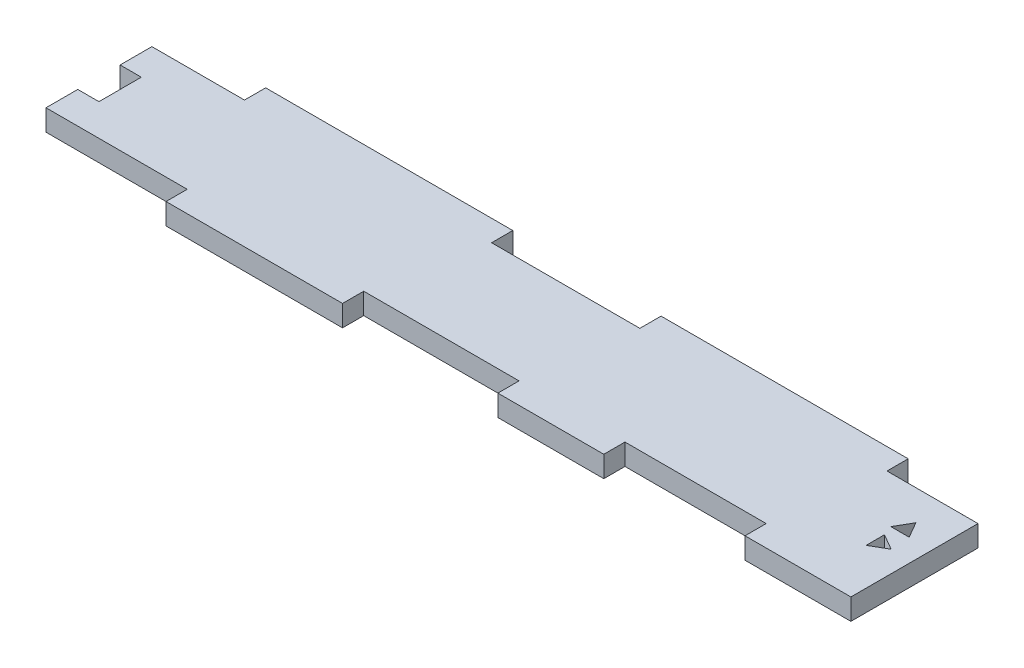
ISO-10303-21;
HEADER;
FILE_DESCRIPTION(('STEP AP214'),'2;1');
FILE_NAME('part.step','',(''),(''),'','','');
FILE_SCHEMA(('AUTOMOTIVE_DESIGN { 1 0 10303 214 1 1 1 1 }'));
ENDSEC;
DATA;
#1=APPLICATION_CONTEXT('core data for automotive mechanical design processes');
#2=APPLICATION_PROTOCOL_DEFINITION('international standard','automotive_design',2000,#1);
#3=PRODUCT_CONTEXT('',#1,'mechanical');
#4=PRODUCT('Part','Part','',(#3));
#5=PRODUCT_RELATED_PRODUCT_CATEGORY('part','',(#4));
#6=PRODUCT_DEFINITION_FORMATION('','',#4);
#7=PRODUCT_DEFINITION_CONTEXT('part definition',#1,'design');
#8=PRODUCT_DEFINITION('design','',#6,#7);
#9=PRODUCT_DEFINITION_SHAPE('','',#8);
#10=(LENGTH_UNIT() NAMED_UNIT(*) SI_UNIT(.MILLI.,.METRE.));
#11=(NAMED_UNIT(*) PLANE_ANGLE_UNIT() SI_UNIT($,.RADIAN.));
#12=(NAMED_UNIT(*) SI_UNIT($,.STERADIAN.) SOLID_ANGLE_UNIT());
#13=UNCERTAINTY_MEASURE_WITH_UNIT(LENGTH_MEASURE(1.E-05),#10,'distance_accuracy_value','');
#14=(GEOMETRIC_REPRESENTATION_CONTEXT(3) GLOBAL_UNCERTAINTY_ASSIGNED_CONTEXT((#13)) GLOBAL_UNIT_ASSIGNED_CONTEXT((#10,
#11,#12)) REPRESENTATION_CONTEXT('',''));
#15=CARTESIAN_POINT('',(0.,0.,0.));
#16=DIRECTION('',(0.,0.,1.));
#17=DIRECTION('',(1.,0.,0.));
#18=AXIS2_PLACEMENT_3D('',#15,#16,#17);
#19=CARTESIAN_POINT('',(-58.5,1.5,-7.5));
#20=DIRECTION('',(1.,0.,0.));
#21=DIRECTION('',(0.,0.,-1.));
#22=AXIS2_PLACEMENT_3D('',#19,#20,#21);
#23=PLANE('',#22);
#24=DIRECTION('',(0.,0.,1.));
#25=VECTOR('',#24,1.);
#26=CARTESIAN_POINT('',(-58.5,-1.5,-7.5));
#27=LINE('',#26,#25);
#28=CARTESIAN_POINT('',(-58.5,-1.5,-7.5));
#29=VERTEX_POINT('',#28);
#30=CARTESIAN_POINT('',(-58.5,-1.5,-3.));
#31=VERTEX_POINT('',#30);
#32=EDGE_CURVE('E292',#29,#31,#27,.T.);
#33=ORIENTED_EDGE('',*,*,#32,.T.);
#34=DIRECTION('',(0.,1.,0.));
#35=VECTOR('',#34,1.);
#36=CARTESIAN_POINT('',(-58.5,-1.5,-3.));
#37=LINE('',#36,#35);
#38=CARTESIAN_POINT('',(-58.5,1.5,-3.));
#39=VERTEX_POINT('',#38);
#40=EDGE_CURVE('E496',#31,#39,#37,.T.);
#41=ORIENTED_EDGE('',*,*,#40,.T.);
#42=DIRECTION('',(0.,0.,1.));
#43=VECTOR('',#42,1.);
#44=CARTESIAN_POINT('',(-58.5,1.5,-7.5));
#45=LINE('',#44,#43);
#46=CARTESIAN_POINT('',(-58.5,1.5,-7.5));
#47=VERTEX_POINT('',#46);
#48=EDGE_CURVE('E269',#47,#39,#45,.T.);
#49=ORIENTED_EDGE('',*,*,#48,.F.);
#50=DIRECTION('',(0.,-1.,0.));
#51=VECTOR('',#50,1.);
#52=CARTESIAN_POINT('',(-58.5,1.5,-7.5));
#53=LINE('',#52,#51);
#54=EDGE_CURVE('E290',#47,#29,#53,.T.);
#55=ORIENTED_EDGE('',*,*,#54,.T.);
#56=EDGE_LOOP('',(#33,#41,#49,#55));
#57=FACE_BOUND('',#56,.T.);
#58=ADVANCED_FACE('F36',(#57),#23,.F.);
#59=CARTESIAN_POINT('',(-58.5,1.5,-7.5));
#60=DIRECTION('',(0.,0.,1.));
#61=DIRECTION('',(1.,0.,0.));
#62=AXIS2_PLACEMENT_3D('',#59,#60,#61);
#63=PLANE('',#62);
#64=DIRECTION('',(0.,-1.,0.));
#65=VECTOR('',#64,1.);
#66=CARTESIAN_POINT('',(10.61,1.5,-7.49999999999999));
#67=LINE('',#66,#65);
#68=CARTESIAN_POINT('',(10.61,1.5,-7.5));
#69=VERTEX_POINT('',#68);
#70=CARTESIAN_POINT('',(10.61,-1.5,-7.49999999999999));
#71=VERTEX_POINT('',#70);
#72=EDGE_CURVE('E339',#69,#71,#67,.T.);
#73=ORIENTED_EDGE('',*,*,#72,.T.);
#74=DIRECTION('',(-1.,0.,0.));
#75=VECTOR('',#74,1.);
#76=CARTESIAN_POINT('',(-58.5,-1.5,-7.5));
#77=LINE('',#76,#75);
#78=CARTESIAN_POINT('',(-10.39,-1.5,-7.49999999999999));
#79=VERTEX_POINT('',#78);
#80=EDGE_CURVE('E274',#71,#79,#77,.T.);
#81=ORIENTED_EDGE('',*,*,#80,.T.);
#82=DIRECTION('',(0.,-1.,0.));
#83=VECTOR('',#82,1.);
#84=CARTESIAN_POINT('',(-10.39,1.5,-7.49999999999999));
#85=LINE('',#84,#83);
#86=CARTESIAN_POINT('',(-10.39,1.5,-7.49999999999999));
#87=VERTEX_POINT('',#86);
#88=EDGE_CURVE('E360',#87,#79,#85,.T.);
#89=ORIENTED_EDGE('',*,*,#88,.F.);
#90=DIRECTION('',(-1.,0.,0.));
#91=VECTOR('',#90,1.);
#92=CARTESIAN_POINT('',(-58.5,1.5,-7.5));
#93=LINE('',#92,#91);
#94=EDGE_CURVE('E291',#69,#87,#93,.T.);
#95=ORIENTED_EDGE('',*,*,#94,.F.);
#96=EDGE_LOOP('',(#73,#81,#89,#95));
#97=FACE_BOUND('',#96,.T.);
#98=ADVANCED_FACE('F485',(#97),#63,.F.);
#99=DIRECTION('',(0.,-1.,0.));
#100=VECTOR('',#99,1.);
#101=CARTESIAN_POINT('',(45.61,1.5,-7.49999999999999));
#102=LINE('',#101,#100);
#103=CARTESIAN_POINT('',(45.61,1.5,-7.49999999999999));
#104=VERTEX_POINT('',#103);
#105=CARTESIAN_POINT('',(45.61,-1.5,-7.49999999999999));
#106=VERTEX_POINT('',#105);
#107=EDGE_CURVE('E337',#104,#106,#102,.T.);
#108=ORIENTED_EDGE('',*,*,#107,.F.);
#109=CARTESIAN_POINT('',(58.5,1.5,-7.49999999999999));
#110=VERTEX_POINT('',#109);
#111=EDGE_CURVE('E287',#110,#104,#93,.T.);
#112=ORIENTED_EDGE('',*,*,#111,.F.);
#113=DIRECTION('',(0.,-1.,0.));
#114=VECTOR('',#113,1.);
#115=CARTESIAN_POINT('',(58.5,1.5,-7.49999999999999));
#116=LINE('',#115,#114);
#117=CARTESIAN_POINT('',(58.5,-1.5,-7.49999999999999));
#118=VERTEX_POINT('',#117);
#119=EDGE_CURVE('E44',#110,#118,#116,.T.);
#120=ORIENTED_EDGE('',*,*,#119,.T.);
#121=EDGE_CURVE('E270',#118,#106,#77,.T.);
#122=ORIENTED_EDGE('',*,*,#121,.T.);
#123=EDGE_LOOP('',(#108,#112,#120,#122));
#124=FACE_BOUND('',#123,.T.);
#125=ADVANCED_FACE('F308',(#124),#63,.F.);
#126=CARTESIAN_POINT('',(-58.5,1.5,7.5));
#127=DIRECTION('',(0.,0.,-1.));
#128=DIRECTION('',(-1.,0.,0.));
#129=AXIS2_PLACEMENT_3D('',#126,#127,#128);
#130=PLANE('',#129);
#131=DIRECTION('',(0.,-1.,0.));
#132=VECTOR('',#131,1.);
#133=CARTESIAN_POINT('',(-38.5,1.5,7.5));
#134=LINE('',#133,#132);
#135=CARTESIAN_POINT('',(-38.5,1.5,7.5));
#136=VERTEX_POINT('',#135);
#137=CARTESIAN_POINT('',(-38.5,-1.5,7.5));
#138=VERTEX_POINT('',#137);
#139=EDGE_CURVE('E376',#136,#138,#134,.T.);
#140=ORIENTED_EDGE('',*,*,#139,.F.);
#141=DIRECTION('',(1.,0.,0.));
#142=VECTOR('',#141,1.);
#143=CARTESIAN_POINT('',(-58.5,1.5,7.5));
#144=LINE('',#143,#142);
#145=CARTESIAN_POINT('',(-58.5,1.5,7.5));
#146=VERTEX_POINT('',#145);
#147=EDGE_CURVE('E281',#146,#136,#144,.T.);
#148=ORIENTED_EDGE('',*,*,#147,.F.);
#149=DIRECTION('',(0.,-1.,0.));
#150=VECTOR('',#149,1.);
#151=CARTESIAN_POINT('',(-58.5,1.5,7.5));
#152=LINE('',#151,#150);
#153=CARTESIAN_POINT('',(-58.5,-1.5,7.5));
#154=VERTEX_POINT('',#153);
#155=EDGE_CURVE('E11',#146,#154,#152,.T.);
#156=ORIENTED_EDGE('',*,*,#155,.T.);
#157=DIRECTION('',(1.,0.,0.));
#158=VECTOR('',#157,1.);
#159=CARTESIAN_POINT('',(-58.5,-1.5,7.5));
#160=LINE('',#159,#158);
#161=EDGE_CURVE('E297',#154,#138,#160,.T.);
#162=ORIENTED_EDGE('',*,*,#161,.T.);
#163=EDGE_LOOP('',(#140,#148,#156,#162));
#164=FACE_BOUND('',#163,.T.);
#165=ADVANCED_FACE('F445',(#164),#130,.F.);
#166=DIRECTION('',(0.,-1.,0.));
#167=VECTOR('',#166,1.);
#168=CARTESIAN_POINT('',(-13.5,1.5,7.5));
#169=LINE('',#168,#167);
#170=CARTESIAN_POINT('',(-13.5,1.5,7.5));
#171=VERTEX_POINT('',#170);
#172=CARTESIAN_POINT('',(-13.5,-1.5,7.5));
#173=VERTEX_POINT('',#172);
#174=EDGE_CURVE('E385',#171,#173,#169,.T.);
#175=ORIENTED_EDGE('',*,*,#174,.T.);
#176=CARTESIAN_POINT('',(8.5,-1.5,7.5));
#177=VERTEX_POINT('',#176);
#178=EDGE_CURVE('E300',#173,#177,#160,.T.);
#179=ORIENTED_EDGE('',*,*,#178,.T.);
#180=DIRECTION('',(0.,-1.,0.));
#181=VECTOR('',#180,1.);
#182=CARTESIAN_POINT('',(8.5,1.5,7.5));
#183=LINE('',#182,#181);
#184=CARTESIAN_POINT('',(8.5,1.5,7.5));
#185=VERTEX_POINT('',#184);
#186=EDGE_CURVE('E423',#185,#177,#183,.T.);
#187=ORIENTED_EDGE('',*,*,#186,.F.);
#188=EDGE_CURVE('E284',#171,#185,#144,.T.);
#189=ORIENTED_EDGE('',*,*,#188,.F.);
#190=EDGE_LOOP('',(#175,#179,#187,#189));
#191=FACE_BOUND('',#190,.T.);
#192=ADVANCED_FACE('F460',(#191),#130,.F.);
#193=DIRECTION('',(0.,-1.,0.));
#194=VECTOR('',#193,1.);
#195=CARTESIAN_POINT('',(43.5,1.5,7.5));
#196=LINE('',#195,#194);
#197=CARTESIAN_POINT('',(43.5,1.5,7.49999999999999));
#198=VERTEX_POINT('',#197);
#199=CARTESIAN_POINT('',(43.5,-1.5,7.49999999999999));
#200=VERTEX_POINT('',#199);
#201=EDGE_CURVE('E402',#198,#200,#196,.T.);
#202=ORIENTED_EDGE('',*,*,#201,.F.);
#203=CARTESIAN_POINT('',(23.5,1.5,7.5));
#204=VERTEX_POINT('',#203);
#205=EDGE_CURVE('E273',#204,#198,#144,.T.);
#206=ORIENTED_EDGE('',*,*,#205,.F.);
#207=DIRECTION('',(0.,-1.,0.));
#208=VECTOR('',#207,1.);
#209=CARTESIAN_POINT('',(23.5,1.5,7.5));
#210=LINE('',#209,#208);
#211=CARTESIAN_POINT('',(23.5,-1.5,7.49999999999999));
#212=VERTEX_POINT('',#211);
#213=EDGE_CURVE('E431',#204,#212,#210,.T.);
#214=ORIENTED_EDGE('',*,*,#213,.T.);
#215=EDGE_CURVE('E295',#212,#200,#160,.T.);
#216=ORIENTED_EDGE('',*,*,#215,.T.);
#217=EDGE_LOOP('',(#202,#206,#214,#216));
#218=FACE_BOUND('',#217,.T.);
#219=ADVANCED_FACE('F486',(#218),#130,.F.);
#220=CARTESIAN_POINT('',(-58.5,1.5,3.));
#221=VERTEX_POINT('',#220);
#222=EDGE_CURVE('E263',#221,#146,#45,.T.);
#223=ORIENTED_EDGE('',*,*,#222,.F.);
#224=DIRECTION('',(0.,1.,0.));
#225=VECTOR('',#224,1.);
#226=CARTESIAN_POINT('',(-58.5,-1.5,3.));
#227=LINE('',#226,#225);
#228=CARTESIAN_POINT('',(-58.5,-1.5,3.));
#229=VERTEX_POINT('',#228);
#230=EDGE_CURVE('E245',#229,#221,#227,.T.);
#231=ORIENTED_EDGE('',*,*,#230,.F.);
#232=EDGE_CURVE('E296',#229,#154,#27,.T.);
#233=ORIENTED_EDGE('',*,*,#232,.T.);
#234=ORIENTED_EDGE('',*,*,#155,.F.);
#235=EDGE_LOOP('',(#223,#231,#233,#234));
#236=FACE_BOUND('',#235,.T.);
#237=ADVANCED_FACE('F38',(#236),#23,.F.);
#238=CARTESIAN_POINT('',(58.5,1.5,-7.49999999999999));
#239=DIRECTION('',(-1.,0.,0.));
#240=DIRECTION('',(0.,0.,1.));
#241=AXIS2_PLACEMENT_3D('',#238,#239,#240);
#242=PLANE('',#241);
#243=DIRECTION('',(0.,0.,-1.));
#244=VECTOR('',#243,1.);
#245=CARTESIAN_POINT('',(58.5,-1.5,-7.49999999999999));
#246=LINE('',#245,#244);
#247=CARTESIAN_POINT('',(58.5,-1.5,10.5));
#248=VERTEX_POINT('',#247);
#249=EDGE_CURVE('E299',#248,#118,#246,.T.);
#250=ORIENTED_EDGE('',*,*,#249,.T.);
#251=ORIENTED_EDGE('',*,*,#119,.F.);
#252=DIRECTION('',(0.,0.,-1.));
#253=VECTOR('',#252,1.);
#254=CARTESIAN_POINT('',(58.5,1.5,-7.49999999999999));
#255=LINE('',#254,#253);
#256=CARTESIAN_POINT('',(58.5,1.5,10.5));
#257=VERTEX_POINT('',#256);
#258=EDGE_CURVE('E283',#257,#110,#255,.T.);
#259=ORIENTED_EDGE('',*,*,#258,.F.);
#260=DIRECTION('',(0.,-1.,0.));
#261=VECTOR('',#260,1.);
#262=CARTESIAN_POINT('',(58.5,1.5,10.5));
#263=LINE('',#262,#261);
#264=EDGE_CURVE('E408',#257,#248,#263,.T.);
#265=ORIENTED_EDGE('',*,*,#264,.T.);
#266=EDGE_LOOP('',(#250,#251,#259,#265));
#267=FACE_BOUND('',#266,.T.);
#268=ADVANCED_FACE('F475',(#267),#242,.F.);
#269=CARTESIAN_POINT('',(-45.39,1.5,-7.49999999999999));
#270=VERTEX_POINT('',#269);
#271=EDGE_CURVE('E286',#270,#47,#93,.T.);
#272=ORIENTED_EDGE('',*,*,#271,.F.);
#273=DIRECTION('',(0.,-1.,0.));
#274=VECTOR('',#273,1.);
#275=CARTESIAN_POINT('',(-45.39,1.5,-7.49999999999999));
#276=LINE('',#275,#274);
#277=CARTESIAN_POINT('',(-45.39,-1.5,-7.5));
#278=VERTEX_POINT('',#277);
#279=EDGE_CURVE('E363',#270,#278,#276,.T.);
#280=ORIENTED_EDGE('',*,*,#279,.T.);
#281=EDGE_CURVE('E276',#278,#29,#77,.T.);
#282=ORIENTED_EDGE('',*,*,#281,.T.);
#283=ORIENTED_EDGE('',*,*,#54,.F.);
#284=EDGE_LOOP('',(#272,#280,#282,#283));
#285=FACE_BOUND('',#284,.T.);
#286=ADVANCED_FACE('F477',(#285),#63,.F.);
#287=CARTESIAN_POINT('',(0.,1.5,0.));
#288=DIRECTION('',(0.,1.,0.));
#289=DIRECTION('',(0.,0.,1.));
#290=AXIS2_PLACEMENT_3D('',#287,#288,#289);
#291=PLANE('',#290);
#292=DIRECTION('',(-1.,0.,0.));
#293=VECTOR('',#292,1.);
#294=CARTESIAN_POINT('',(-58.5,1.5,-3.));
#295=LINE('',#294,#293);
#296=CARTESIAN_POINT('',(-55.5,1.5,-3.));
#297=VERTEX_POINT('',#296);
#298=EDGE_CURVE('E759',#297,#39,#295,.T.);
#299=ORIENTED_EDGE('',*,*,#298,.F.);
#300=DIRECTION('',(0.,0.,-1.));
#301=VECTOR('',#300,1.);
#302=CARTESIAN_POINT('',(-55.5,1.5,-3.));
#303=LINE('',#302,#301);
#304=CARTESIAN_POINT('',(-55.5,1.5,3.));
#305=VERTEX_POINT('',#304);
#306=EDGE_CURVE('E266',#305,#297,#303,.T.);
#307=ORIENTED_EDGE('',*,*,#306,.F.);
#308=DIRECTION('',(1.,0.,0.));
#309=VECTOR('',#308,1.);
#310=CARTESIAN_POINT('',(-58.5,1.5,3.));
#311=LINE('',#310,#309);
#312=EDGE_CURVE('E248',#221,#305,#311,.T.);
#313=ORIENTED_EDGE('',*,*,#312,.F.);
#314=ORIENTED_EDGE('',*,*,#222,.T.);
#315=ORIENTED_EDGE('',*,*,#147,.T.);
#316=DIRECTION('',(0.,0.,1.));
#317=VECTOR('',#316,1.);
#318=CARTESIAN_POINT('',(-38.5,1.5,7.5));
#319=LINE('',#318,#317);
#320=CARTESIAN_POINT('',(-38.5,1.5,10.5));
#321=VERTEX_POINT('',#320);
#322=EDGE_CURVE('E367',#136,#321,#319,.T.);
#323=ORIENTED_EDGE('',*,*,#322,.T.);
#324=DIRECTION('',(1.,0.,0.));
#325=VECTOR('',#324,1.);
#326=CARTESIAN_POINT('',(-38.5,1.5,10.5));
#327=LINE('',#326,#325);
#328=CARTESIAN_POINT('',(-13.5,1.5,10.5));
#329=VERTEX_POINT('',#328);
#330=EDGE_CURVE('E370',#321,#329,#327,.T.);
#331=ORIENTED_EDGE('',*,*,#330,.T.);
#332=DIRECTION('',(0.,0.,-1.));
#333=VECTOR('',#332,1.);
#334=CARTESIAN_POINT('',(-13.5,1.5,7.5));
#335=LINE('',#334,#333);
#336=EDGE_CURVE('E373',#329,#171,#335,.T.);
#337=ORIENTED_EDGE('',*,*,#336,.T.);
#338=ORIENTED_EDGE('',*,*,#188,.T.);
#339=DIRECTION('',(0.,0.,1.));
#340=VECTOR('',#339,1.);
#341=CARTESIAN_POINT('',(8.5,1.5,7.5));
#342=LINE('',#341,#340);
#343=CARTESIAN_POINT('',(8.5,1.5,10.5));
#344=VERTEX_POINT('',#343);
#345=EDGE_CURVE('E415',#185,#344,#342,.T.);
#346=ORIENTED_EDGE('',*,*,#345,.T.);
#347=DIRECTION('',(1.,0.,0.));
#348=VECTOR('',#347,1.);
#349=CARTESIAN_POINT('',(8.5,1.5,10.5));
#350=LINE('',#349,#348);
#351=CARTESIAN_POINT('',(23.5,1.5,10.5));
#352=VERTEX_POINT('',#351);
#353=EDGE_CURVE('E418',#344,#352,#350,.T.);
#354=ORIENTED_EDGE('',*,*,#353,.T.);
#355=DIRECTION('',(0.,0.,-1.));
#356=VECTOR('',#355,1.);
#357=CARTESIAN_POINT('',(23.5,1.5,7.5));
#358=LINE('',#357,#356);
#359=EDGE_CURVE('E421',#352,#204,#358,.T.);
#360=ORIENTED_EDGE('',*,*,#359,.T.);
#361=ORIENTED_EDGE('',*,*,#205,.T.);
#362=DIRECTION('',(0.,0.,1.));
#363=VECTOR('',#362,1.);
#364=CARTESIAN_POINT('',(43.5,1.5,7.5));
#365=LINE('',#364,#363);
#366=CARTESIAN_POINT('',(43.5,1.5,10.5));
#367=VERTEX_POINT('',#366);
#368=EDGE_CURVE('E395',#198,#367,#365,.T.);
#369=ORIENTED_EDGE('',*,*,#368,.T.);
#370=DIRECTION('',(1.,0.,0.));
#371=VECTOR('',#370,1.);
#372=CARTESIAN_POINT('',(43.5,1.5,10.5));
#373=LINE('',#372,#371);
#374=EDGE_CURVE('E398',#367,#257,#373,.T.);
#375=ORIENTED_EDGE('',*,*,#374,.T.);
#376=ORIENTED_EDGE('',*,*,#258,.T.);
#377=ORIENTED_EDGE('',*,*,#111,.T.);
#378=DIRECTION('',(0.,0.,-1.));
#379=VECTOR('',#378,1.);
#380=CARTESIAN_POINT('',(45.61,1.5,-10.5));
#381=LINE('',#380,#379);
#382=CARTESIAN_POINT('',(45.61,1.5,-10.5));
#383=VERTEX_POINT('',#382);
#384=EDGE_CURVE('E558',#104,#383,#381,.T.);
#385=ORIENTED_EDGE('',*,*,#384,.T.);
#386=DIRECTION('',(-1.,0.,0.));
#387=VECTOR('',#386,1.);
#388=CARTESIAN_POINT('',(10.61,1.5,-10.5));
#389=LINE('',#388,#387);
#390=CARTESIAN_POINT('',(10.61,1.5,-10.5));
#391=VERTEX_POINT('',#390);
#392=EDGE_CURVE('E335',#383,#391,#389,.T.);
#393=ORIENTED_EDGE('',*,*,#392,.T.);
#394=DIRECTION('',(0.,0.,1.));
#395=VECTOR('',#394,1.);
#396=CARTESIAN_POINT('',(10.61,1.5,-10.5));
#397=LINE('',#396,#395);
#398=EDGE_CURVE('E324',#391,#69,#397,.T.);
#399=ORIENTED_EDGE('',*,*,#398,.T.);
#400=ORIENTED_EDGE('',*,*,#94,.T.);
#401=DIRECTION('',(0.,0.,-1.));
#402=VECTOR('',#401,1.);
#403=CARTESIAN_POINT('',(-10.39,1.5,-7.49999999999999));
#404=LINE('',#403,#402);
#405=CARTESIAN_POINT('',(-10.39,1.5,-10.5));
#406=VERTEX_POINT('',#405);
#407=EDGE_CURVE('E345',#87,#406,#404,.T.);
#408=ORIENTED_EDGE('',*,*,#407,.T.);
#409=DIRECTION('',(-1.,0.,0.));
#410=VECTOR('',#409,1.);
#411=CARTESIAN_POINT('',(-45.39,1.5,-10.5));
#412=LINE('',#411,#410);
#413=CARTESIAN_POINT('',(-45.39,1.5,-10.5));
#414=VERTEX_POINT('',#413);
#415=EDGE_CURVE('E348',#406,#414,#412,.T.);
#416=ORIENTED_EDGE('',*,*,#415,.T.);
#417=DIRECTION('',(0.,0.,1.));
#418=VECTOR('',#417,1.);
#419=CARTESIAN_POINT('',(-45.39,1.5,-7.49999999999999));
#420=LINE('',#419,#418);
#421=EDGE_CURVE('E343',#414,#270,#420,.T.);
#422=ORIENTED_EDGE('',*,*,#421,.T.);
#423=ORIENTED_EDGE('',*,*,#271,.T.);
#424=ORIENTED_EDGE('',*,*,#48,.T.);
#425=EDGE_LOOP('',(#299,#307,#313,#314,#315,#323,#331,#337,#338,#346,#354,#360,#361,#369,#375,
#376,#377,#385,#393,#399,#400,#408,#416,#422,#423,#424));
#426=FACE_BOUND('',#425,.T.);
#427=DIRECTION('',(0.866025403784438,0.,-0.500000000000001));
#428=VECTOR('',#427,1.);
#429=CARTESIAN_POINT('',(53.25,1.5,3.09807621135332));
#430=LINE('',#429,#428);
#431=CARTESIAN_POINT('',(53.25,1.5,3.09807621135332));
#432=VERTEX_POINT('',#431);
#433=CARTESIAN_POINT('',(55.5,1.5,1.79903810567665));
#434=VERTEX_POINT('',#433);
#435=EDGE_CURVE('E59',#432,#434,#430,.T.);
#436=ORIENTED_EDGE('',*,*,#435,.F.);
#437=DIRECTION('',(0.,0.,1.));
#438=VECTOR('',#437,1.);
#439=CARTESIAN_POINT('',(53.25,1.5,0.5));
#440=LINE('',#439,#438);
#441=CARTESIAN_POINT('',(53.25,1.5,0.5));
#442=VERTEX_POINT('',#441);
#443=EDGE_CURVE('E517',#442,#432,#440,.T.);
#444=ORIENTED_EDGE('',*,*,#443,.F.);
#445=DIRECTION('',(-0.866025403784441,0.,-0.499999999999997));
#446=VECTOR('',#445,1.);
#447=CARTESIAN_POINT('',(55.5,1.5,1.79903810567665));
#448=LINE('',#447,#446);
#449=EDGE_CURVE('E513',#434,#442,#448,.T.);
#450=ORIENTED_EDGE('',*,*,#449,.F.);
#451=EDGE_LOOP('',(#436,#444,#450));
#452=FACE_BOUND('',#451,.T.);
#453=DIRECTION('',(-0.5,0.,-0.866025403784438));
#454=VECTOR('',#453,1.);
#455=CARTESIAN_POINT('',(55.2990381056767,1.5,-0.952955395936156));
#456=LINE('',#455,#454);
#457=CARTESIAN_POINT('',(55.2990381056767,1.5,-0.952955395936156));
#458=VERTEX_POINT('',#457);
#459=CARTESIAN_POINT('',(54.,1.5,-3.20295539593614));
#460=VERTEX_POINT('',#459);
#461=EDGE_CURVE('E508',#458,#460,#456,.T.);
#462=ORIENTED_EDGE('',*,*,#461,.F.);
#463=DIRECTION('',(1.,0.,0.));
#464=VECTOR('',#463,1.);
#465=CARTESIAN_POINT('',(52.7009618943233,1.5,-0.952955395936156));
#466=LINE('',#465,#464);
#467=CARTESIAN_POINT('',(52.7009618943233,1.5,-0.952955395936156));
#468=VERTEX_POINT('',#467);
#469=EDGE_CURVE('E538',#468,#458,#466,.T.);
#470=ORIENTED_EDGE('',*,*,#469,.F.);
#471=DIRECTION('',(-0.5,0.,0.866025403784438));
#472=VECTOR('',#471,1.);
#473=CARTESIAN_POINT('',(54.,1.5,-3.20295539593614));
#474=LINE('',#473,#472);
#475=EDGE_CURVE('E535',#460,#468,#474,.T.);
#476=ORIENTED_EDGE('',*,*,#475,.F.);
#477=EDGE_LOOP('',(#462,#470,#476));
#478=FACE_BOUND('',#477,.T.);
#479=ADVANCED_FACE('F260',(#426,#452,#478),#291,.T.);
#480=CARTESIAN_POINT('',(0.,-1.5,0.));
#481=DIRECTION('',(0.,1.,0.));
#482=DIRECTION('',(0.,0.,1.));
#483=AXIS2_PLACEMENT_3D('',#480,#481,#482);
#484=PLANE('',#483);
#485=DIRECTION('',(0.,0.,1.));
#486=VECTOR('',#485,1.);
#487=CARTESIAN_POINT('',(53.25,-1.5,0.5));
#488=LINE('',#487,#486);
#489=CARTESIAN_POINT('',(53.25,-1.5,0.499999999999997));
#490=VERTEX_POINT('',#489);
#491=CARTESIAN_POINT('',(53.25,-1.5,3.09807621135332));
#492=VERTEX_POINT('',#491);
#493=EDGE_CURVE('E526',#490,#492,#488,.T.);
#494=ORIENTED_EDGE('',*,*,#493,.T.);
#495=DIRECTION('',(0.866025403784438,0.,-0.500000000000001));
#496=VECTOR('',#495,1.);
#497=CARTESIAN_POINT('',(53.25,-1.5,3.09807621135332));
#498=LINE('',#497,#496);
#499=CARTESIAN_POINT('',(55.5,-1.5,1.79903810567665));
#500=VERTEX_POINT('',#499);
#501=EDGE_CURVE('E520',#492,#500,#498,.T.);
#502=ORIENTED_EDGE('',*,*,#501,.T.);
#503=DIRECTION('',(-0.866025403784441,0.,-0.499999999999997));
#504=VECTOR('',#503,1.);
#505=CARTESIAN_POINT('',(55.5,-1.5,1.79903810567665));
#506=LINE('',#505,#504);
#507=EDGE_CURVE('E523',#500,#490,#506,.T.);
#508=ORIENTED_EDGE('',*,*,#507,.T.);
#509=EDGE_LOOP('',(#494,#502,#508));
#510=FACE_BOUND('',#509,.T.);
#511=DIRECTION('',(1.,0.,0.));
#512=VECTOR('',#511,1.);
#513=CARTESIAN_POINT('',(52.7009618943233,-1.5,-0.952955395936156));
#514=LINE('',#513,#512);
#515=CARTESIAN_POINT('',(52.7009618943234,-1.5,-0.952955395936157));
#516=VERTEX_POINT('',#515);
#517=CARTESIAN_POINT('',(55.2990381056767,-1.5,-0.952955395936156));
#518=VERTEX_POINT('',#517);
#519=EDGE_CURVE('E547',#516,#518,#514,.T.);
#520=ORIENTED_EDGE('',*,*,#519,.T.);
#521=DIRECTION('',(-0.5,0.,-0.866025403784438));
#522=VECTOR('',#521,1.);
#523=CARTESIAN_POINT('',(55.2990381056767,-1.5,-0.952955395936156));
#524=LINE('',#523,#522);
#525=CARTESIAN_POINT('',(54.,-1.5,-3.20295539593614));
#526=VERTEX_POINT('',#525);
#527=EDGE_CURVE('E541',#518,#526,#524,.T.);
#528=ORIENTED_EDGE('',*,*,#527,.T.);
#529=DIRECTION('',(-0.5,0.,0.866025403784438));
#530=VECTOR('',#529,1.);
#531=CARTESIAN_POINT('',(54.,-1.5,-3.20295539593614));
#532=LINE('',#531,#530);
#533=EDGE_CURVE('E544',#526,#516,#532,.T.);
#534=ORIENTED_EDGE('',*,*,#533,.T.);
#535=EDGE_LOOP('',(#520,#528,#534));
#536=FACE_BOUND('',#535,.T.);
#537=DIRECTION('',(0.,0.,-1.));
#538=VECTOR('',#537,1.);
#539=CARTESIAN_POINT('',(-55.5,-1.5,-3.));
#540=LINE('',#539,#538);
#541=CARTESIAN_POINT('',(-55.5,-1.5,3.));
#542=VERTEX_POINT('',#541);
#543=CARTESIAN_POINT('',(-55.5,-1.5,-3.));
#544=VERTEX_POINT('',#543);
#545=EDGE_CURVE('E51',#542,#544,#540,.T.);
#546=ORIENTED_EDGE('',*,*,#545,.T.);
#547=DIRECTION('',(-1.,0.,0.));
#548=VECTOR('',#547,1.);
#549=CARTESIAN_POINT('',(-58.5,-1.5,-3.));
#550=LINE('',#549,#548);
#551=EDGE_CURVE('E256',#544,#31,#550,.T.);
#552=ORIENTED_EDGE('',*,*,#551,.T.);
#553=ORIENTED_EDGE('',*,*,#32,.F.);
#554=ORIENTED_EDGE('',*,*,#281,.F.);
#555=DIRECTION('',(0.,0.,1.));
#556=VECTOR('',#555,1.);
#557=CARTESIAN_POINT('',(-45.39,-1.5,-7.49999999999999));
#558=LINE('',#557,#556);
#559=CARTESIAN_POINT('',(-45.39,-1.5,-10.5));
#560=VERTEX_POINT('',#559);
#561=EDGE_CURVE('E342',#560,#278,#558,.T.);
#562=ORIENTED_EDGE('',*,*,#561,.F.);
#563=DIRECTION('',(-1.,0.,0.));
#564=VECTOR('',#563,1.);
#565=CARTESIAN_POINT('',(-45.39,-1.5,-10.5));
#566=LINE('',#565,#564);
#567=CARTESIAN_POINT('',(-10.39,-1.5,-10.5));
#568=VERTEX_POINT('',#567);
#569=EDGE_CURVE('E346',#568,#560,#566,.T.);
#570=ORIENTED_EDGE('',*,*,#569,.F.);
#571=DIRECTION('',(0.,0.,-1.));
#572=VECTOR('',#571,1.);
#573=CARTESIAN_POINT('',(-10.39,-1.5,-7.49999999999999));
#574=LINE('',#573,#572);
#575=EDGE_CURVE('E352',#79,#568,#574,.T.);
#576=ORIENTED_EDGE('',*,*,#575,.F.);
#577=ORIENTED_EDGE('',*,*,#80,.F.);
#578=DIRECTION('',(0.,0.,1.));
#579=VECTOR('',#578,1.);
#580=CARTESIAN_POINT('',(10.61,-1.5,-10.5));
#581=LINE('',#580,#579);
#582=CARTESIAN_POINT('',(10.61,-1.5,-10.5));
#583=VERTEX_POINT('',#582);
#584=EDGE_CURVE('E322',#583,#71,#581,.T.);
#585=ORIENTED_EDGE('',*,*,#584,.F.);
#586=DIRECTION('',(-1.,0.,0.));
#587=VECTOR('',#586,1.);
#588=CARTESIAN_POINT('',(10.61,-1.5,-10.5));
#589=LINE('',#588,#587);
#590=CARTESIAN_POINT('',(45.61,-1.5,-10.5));
#591=VERTEX_POINT('',#590);
#592=EDGE_CURVE('E318',#591,#583,#589,.T.);
#593=ORIENTED_EDGE('',*,*,#592,.F.);
#594=DIRECTION('',(0.,0.,-1.));
#595=VECTOR('',#594,1.);
#596=CARTESIAN_POINT('',(45.61,-1.5,-10.5));
#597=LINE('',#596,#595);
#598=EDGE_CURVE('E316',#106,#591,#597,.T.);
#599=ORIENTED_EDGE('',*,*,#598,.F.);
#600=ORIENTED_EDGE('',*,*,#121,.F.);
#601=ORIENTED_EDGE('',*,*,#249,.F.);
#602=DIRECTION('',(1.,0.,0.));
#603=VECTOR('',#602,1.);
#604=CARTESIAN_POINT('',(43.5,-1.5,10.5));
#605=LINE('',#604,#603);
#606=CARTESIAN_POINT('',(43.5,-1.5,10.5));
#607=VERTEX_POINT('',#606);
#608=EDGE_CURVE('E399',#607,#248,#605,.T.);
#609=ORIENTED_EDGE('',*,*,#608,.F.);
#610=DIRECTION('',(0.,0.,1.));
#611=VECTOR('',#610,1.);
#612=CARTESIAN_POINT('',(43.5,-1.5,7.5));
#613=LINE('',#612,#611);
#614=EDGE_CURVE('E394',#200,#607,#613,.T.);
#615=ORIENTED_EDGE('',*,*,#614,.F.);
#616=ORIENTED_EDGE('',*,*,#215,.F.);
#617=DIRECTION('',(0.,0.,-1.));
#618=VECTOR('',#617,1.);
#619=CARTESIAN_POINT('',(23.5,-1.5,7.5));
#620=LINE('',#619,#618);
#621=CARTESIAN_POINT('',(23.5,-1.5,10.5));
#622=VERTEX_POINT('',#621);
#623=EDGE_CURVE('E419',#622,#212,#620,.T.);
#624=ORIENTED_EDGE('',*,*,#623,.F.);
#625=DIRECTION('',(1.,0.,0.));
#626=VECTOR('',#625,1.);
#627=CARTESIAN_POINT('',(8.5,-1.5,10.5));
#628=LINE('',#627,#626);
#629=CARTESIAN_POINT('',(8.5,-1.5,10.5));
#630=VERTEX_POINT('',#629);
#631=EDGE_CURVE('E426',#630,#622,#628,.T.);
#632=ORIENTED_EDGE('',*,*,#631,.F.);
#633=DIRECTION('',(0.,0.,1.));
#634=VECTOR('',#633,1.);
#635=CARTESIAN_POINT('',(8.5,-1.5,7.5));
#636=LINE('',#635,#634);
#637=EDGE_CURVE('E414',#177,#630,#636,.T.);
#638=ORIENTED_EDGE('',*,*,#637,.F.);
#639=ORIENTED_EDGE('',*,*,#178,.F.);
#640=DIRECTION('',(0.,0.,-1.));
#641=VECTOR('',#640,1.);
#642=CARTESIAN_POINT('',(-13.5,-1.5,7.5));
#643=LINE('',#642,#641);
#644=CARTESIAN_POINT('',(-13.5,-1.5,10.5));
#645=VERTEX_POINT('',#644);
#646=EDGE_CURVE('E371',#645,#173,#643,.T.);
#647=ORIENTED_EDGE('',*,*,#646,.F.);
#648=DIRECTION('',(1.,0.,0.));
#649=VECTOR('',#648,1.);
#650=CARTESIAN_POINT('',(-38.5,-1.5,10.5));
#651=LINE('',#650,#649);
#652=CARTESIAN_POINT('',(-38.5,-1.5,10.5));
#653=VERTEX_POINT('',#652);
#654=EDGE_CURVE('E379',#653,#645,#651,.T.);
#655=ORIENTED_EDGE('',*,*,#654,.F.);
#656=DIRECTION('',(0.,0.,1.));
#657=VECTOR('',#656,1.);
#658=CARTESIAN_POINT('',(-38.5,-1.5,7.5));
#659=LINE('',#658,#657);
#660=EDGE_CURVE('E366',#138,#653,#659,.T.);
#661=ORIENTED_EDGE('',*,*,#660,.F.);
#662=ORIENTED_EDGE('',*,*,#161,.F.);
#663=ORIENTED_EDGE('',*,*,#232,.F.);
#664=DIRECTION('',(1.,0.,0.));
#665=VECTOR('',#664,1.);
#666=CARTESIAN_POINT('',(-58.5,-1.5,3.));
#667=LINE('',#666,#665);
#668=EDGE_CURVE('E251',#229,#542,#667,.T.);
#669=ORIENTED_EDGE('',*,*,#668,.T.);
#670=EDGE_LOOP('',(#546,#552,#553,#554,#562,#570,#576,#577,#585,#593,#599,#600,#601,#609,#615,
#616,#624,#632,#638,#639,#647,#655,#661,#662,#663,#669));
#671=FACE_BOUND('',#670,.T.);
#672=ADVANCED_FACE('F313',(#510,#536,#671),#484,.F.);
#673=CARTESIAN_POINT('',(8.5,1.5,7.5));
#674=DIRECTION('',(1.,0.,0.));
#675=DIRECTION('',(0.,0.,-1.));
#676=AXIS2_PLACEMENT_3D('',#673,#674,#675);
#677=PLANE('',#676);
#678=ORIENTED_EDGE('',*,*,#637,.T.);
#679=DIRECTION('',(0.,-1.,0.));
#680=VECTOR('',#679,1.);
#681=CARTESIAN_POINT('',(8.5,1.5,10.5));
#682=LINE('',#681,#680);
#683=EDGE_CURVE('E279',#344,#630,#682,.T.);
#684=ORIENTED_EDGE('',*,*,#683,.F.);
#685=ORIENTED_EDGE('',*,*,#345,.F.);
#686=ORIENTED_EDGE('',*,*,#186,.T.);
#687=EDGE_LOOP('',(#678,#684,#685,#686));
#688=FACE_BOUND('',#687,.T.);
#689=ADVANCED_FACE('F609',(#688),#677,.F.);
#690=CARTESIAN_POINT('',(8.5,1.5,10.5));
#691=DIRECTION('',(0.,0.,-1.));
#692=DIRECTION('',(-1.,0.,0.));
#693=AXIS2_PLACEMENT_3D('',#690,#691,#692);
#694=PLANE('',#693);
#695=ORIENTED_EDGE('',*,*,#631,.T.);
#696=DIRECTION('',(0.,-1.,0.));
#697=VECTOR('',#696,1.);
#698=CARTESIAN_POINT('',(23.5,1.5,10.5));
#699=LINE('',#698,#697);
#700=EDGE_CURVE('E433',#352,#622,#699,.T.);
#701=ORIENTED_EDGE('',*,*,#700,.F.);
#702=ORIENTED_EDGE('',*,*,#353,.F.);
#703=ORIENTED_EDGE('',*,*,#683,.T.);
#704=EDGE_LOOP('',(#695,#701,#702,#703));
#705=FACE_BOUND('',#704,.T.);
#706=ADVANCED_FACE('F606',(#705),#694,.F.);
#707=CARTESIAN_POINT('',(23.5,1.5,7.5));
#708=DIRECTION('',(-1.,0.,0.));
#709=DIRECTION('',(0.,0.,1.));
#710=AXIS2_PLACEMENT_3D('',#707,#708,#709);
#711=PLANE('',#710);
#712=ORIENTED_EDGE('',*,*,#623,.T.);
#713=ORIENTED_EDGE('',*,*,#213,.F.);
#714=ORIENTED_EDGE('',*,*,#359,.F.);
#715=ORIENTED_EDGE('',*,*,#700,.T.);
#716=EDGE_LOOP('',(#712,#713,#714,#715));
#717=FACE_BOUND('',#716,.T.);
#718=ADVANCED_FACE('F603',(#717),#711,.F.);
#719=CARTESIAN_POINT('',(43.5,1.5,7.5));
#720=DIRECTION('',(1.,0.,0.));
#721=DIRECTION('',(0.,0.,-1.));
#722=AXIS2_PLACEMENT_3D('',#719,#720,#721);
#723=PLANE('',#722);
#724=ORIENTED_EDGE('',*,*,#614,.T.);
#725=DIRECTION('',(0.,-1.,0.));
#726=VECTOR('',#725,1.);
#727=CARTESIAN_POINT('',(43.5,1.5,10.5));
#728=LINE('',#727,#726);
#729=EDGE_CURVE('E411',#367,#607,#728,.T.);
#730=ORIENTED_EDGE('',*,*,#729,.F.);
#731=ORIENTED_EDGE('',*,*,#368,.F.);
#732=ORIENTED_EDGE('',*,*,#201,.T.);
#733=EDGE_LOOP('',(#724,#730,#731,#732));
#734=FACE_BOUND('',#733,.T.);
#735=ADVANCED_FACE('F469',(#734),#723,.F.);
#736=CARTESIAN_POINT('',(43.5,1.5,10.5));
#737=DIRECTION('',(0.,0.,-1.));
#738=DIRECTION('',(-1.,0.,0.));
#739=AXIS2_PLACEMENT_3D('',#736,#737,#738);
#740=PLANE('',#739);
#741=ORIENTED_EDGE('',*,*,#608,.T.);
#742=ORIENTED_EDGE('',*,*,#264,.F.);
#743=ORIENTED_EDGE('',*,*,#374,.F.);
#744=ORIENTED_EDGE('',*,*,#729,.T.);
#745=EDGE_LOOP('',(#741,#742,#743,#744));
#746=FACE_BOUND('',#745,.T.);
#747=ADVANCED_FACE('F472',(#746),#740,.F.);
#748=CARTESIAN_POINT('',(-38.5,1.5,7.5));
#749=DIRECTION('',(1.,0.,0.));
#750=DIRECTION('',(0.,0.,-1.));
#751=AXIS2_PLACEMENT_3D('',#748,#749,#750);
#752=PLANE('',#751);
#753=ORIENTED_EDGE('',*,*,#660,.T.);
#754=DIRECTION('',(0.,-1.,0.));
#755=VECTOR('',#754,1.);
#756=CARTESIAN_POINT('',(-38.5,1.5,10.5));
#757=LINE('',#756,#755);
#758=EDGE_CURVE('E391',#321,#653,#757,.T.);
#759=ORIENTED_EDGE('',*,*,#758,.F.);
#760=ORIENTED_EDGE('',*,*,#322,.F.);
#761=ORIENTED_EDGE('',*,*,#139,.T.);
#762=EDGE_LOOP('',(#753,#759,#760,#761));
#763=FACE_BOUND('',#762,.T.);
#764=ADVANCED_FACE('F449',(#763),#752,.F.);
#765=CARTESIAN_POINT('',(-38.5,1.5,10.5));
#766=DIRECTION('',(0.,0.,-1.));
#767=DIRECTION('',(-1.,0.,0.));
#768=AXIS2_PLACEMENT_3D('',#765,#766,#767);
#769=PLANE('',#768);
#770=ORIENTED_EDGE('',*,*,#654,.T.);
#771=DIRECTION('',(0.,-1.,0.));
#772=VECTOR('',#771,1.);
#773=CARTESIAN_POINT('',(-13.5,1.5,10.5));
#774=LINE('',#773,#772);
#775=EDGE_CURVE('E388',#329,#645,#774,.T.);
#776=ORIENTED_EDGE('',*,*,#775,.F.);
#777=ORIENTED_EDGE('',*,*,#330,.F.);
#778=ORIENTED_EDGE('',*,*,#758,.T.);
#779=EDGE_LOOP('',(#770,#776,#777,#778));
#780=FACE_BOUND('',#779,.T.);
#781=ADVANCED_FACE('F451',(#780),#769,.F.);
#782=CARTESIAN_POINT('',(-13.5,1.5,7.5));
#783=DIRECTION('',(-1.,0.,0.));
#784=DIRECTION('',(0.,0.,1.));
#785=AXIS2_PLACEMENT_3D('',#782,#783,#784);
#786=PLANE('',#785);
#787=ORIENTED_EDGE('',*,*,#646,.T.);
#788=ORIENTED_EDGE('',*,*,#174,.F.);
#789=ORIENTED_EDGE('',*,*,#336,.F.);
#790=ORIENTED_EDGE('',*,*,#775,.T.);
#791=EDGE_LOOP('',(#787,#788,#789,#790));
#792=FACE_BOUND('',#791,.T.);
#793=ADVANCED_FACE('F457',(#792),#786,.F.);
#794=CARTESIAN_POINT('',(-45.39,1.5,-7.49999999999999));
#795=DIRECTION('',(1.,0.,0.));
#796=DIRECTION('',(0.,0.,-1.));
#797=AXIS2_PLACEMENT_3D('',#794,#795,#796);
#798=PLANE('',#797);
#799=ORIENTED_EDGE('',*,*,#561,.T.);
#800=ORIENTED_EDGE('',*,*,#279,.F.);
#801=ORIENTED_EDGE('',*,*,#421,.F.);
#802=DIRECTION('',(0.,-1.,0.));
#803=VECTOR('',#802,1.);
#804=CARTESIAN_POINT('',(-45.39,1.5,-10.5));
#805=LINE('',#804,#803);
#806=EDGE_CURVE('E350',#414,#560,#805,.T.);
#807=ORIENTED_EDGE('',*,*,#806,.T.);
#808=EDGE_LOOP('',(#799,#800,#801,#807));
#809=FACE_BOUND('',#808,.T.);
#810=ADVANCED_FACE('F573',(#809),#798,.F.);
#811=CARTESIAN_POINT('',(-10.39,1.5,-7.49999999999999));
#812=DIRECTION('',(-1.,0.,0.));
#813=DIRECTION('',(0.,0.,1.));
#814=AXIS2_PLACEMENT_3D('',#811,#812,#813);
#815=PLANE('',#814);
#816=ORIENTED_EDGE('',*,*,#575,.T.);
#817=DIRECTION('',(0.,-1.,0.));
#818=VECTOR('',#817,1.);
#819=CARTESIAN_POINT('',(-10.39,1.5,-10.5));
#820=LINE('',#819,#818);
#821=EDGE_CURVE('E357',#406,#568,#820,.T.);
#822=ORIENTED_EDGE('',*,*,#821,.F.);
#823=ORIENTED_EDGE('',*,*,#407,.F.);
#824=ORIENTED_EDGE('',*,*,#88,.T.);
#825=EDGE_LOOP('',(#816,#822,#823,#824));
#826=FACE_BOUND('',#825,.T.);
#827=ADVANCED_FACE('F582',(#826),#815,.F.);
#828=CARTESIAN_POINT('',(-45.39,1.5,-10.5));
#829=DIRECTION('',(0.,0.,1.));
#830=DIRECTION('',(1.,0.,0.));
#831=AXIS2_PLACEMENT_3D('',#828,#829,#830);
#832=PLANE('',#831);
#833=ORIENTED_EDGE('',*,*,#569,.T.);
#834=ORIENTED_EDGE('',*,*,#806,.F.);
#835=ORIENTED_EDGE('',*,*,#415,.F.);
#836=ORIENTED_EDGE('',*,*,#821,.T.);
#837=EDGE_LOOP('',(#833,#834,#835,#836));
#838=FACE_BOUND('',#837,.T.);
#839=ADVANCED_FACE('F578',(#838),#832,.F.);
#840=CARTESIAN_POINT('',(10.61,1.5,-10.5));
#841=DIRECTION('',(1.,0.,0.));
#842=DIRECTION('',(0.,0.,-1.));
#843=AXIS2_PLACEMENT_3D('',#840,#841,#842);
#844=PLANE('',#843);
#845=ORIENTED_EDGE('',*,*,#584,.T.);
#846=ORIENTED_EDGE('',*,*,#72,.F.);
#847=ORIENTED_EDGE('',*,*,#398,.F.);
#848=DIRECTION('',(0.,-1.,0.));
#849=VECTOR('',#848,1.);
#850=CARTESIAN_POINT('',(10.61,1.5,-10.5));
#851=LINE('',#850,#849);
#852=EDGE_CURVE('E331',#391,#583,#851,.T.);
#853=ORIENTED_EDGE('',*,*,#852,.T.);
#854=EDGE_LOOP('',(#845,#846,#847,#853));
#855=FACE_BOUND('',#854,.T.);
#856=ADVANCED_FACE('F566',(#855),#844,.F.);
#857=CARTESIAN_POINT('',(45.61,1.5,-10.5));
#858=DIRECTION('',(-1.,0.,0.));
#859=DIRECTION('',(0.,0.,1.));
#860=AXIS2_PLACEMENT_3D('',#857,#858,#859);
#861=PLANE('',#860);
#862=ORIENTED_EDGE('',*,*,#598,.T.);
#863=DIRECTION('',(0.,-1.,0.));
#864=VECTOR('',#863,1.);
#865=CARTESIAN_POINT('',(45.61,1.5,-10.5));
#866=LINE('',#865,#864);
#867=EDGE_CURVE('E334',#383,#591,#866,.T.);
#868=ORIENTED_EDGE('',*,*,#867,.F.);
#869=ORIENTED_EDGE('',*,*,#384,.F.);
#870=ORIENTED_EDGE('',*,*,#107,.T.);
#871=EDGE_LOOP('',(#862,#868,#869,#870));
#872=FACE_BOUND('',#871,.T.);
#873=ADVANCED_FACE('F640',(#872),#861,.F.);
#874=CARTESIAN_POINT('',(10.61,1.5,-10.5));
#875=DIRECTION('',(0.,0.,1.));
#876=DIRECTION('',(1.,0.,0.));
#877=AXIS2_PLACEMENT_3D('',#874,#875,#876);
#878=PLANE('',#877);
#879=ORIENTED_EDGE('',*,*,#592,.T.);
#880=ORIENTED_EDGE('',*,*,#852,.F.);
#881=ORIENTED_EDGE('',*,*,#392,.F.);
#882=ORIENTED_EDGE('',*,*,#867,.T.);
#883=EDGE_LOOP('',(#879,#880,#881,#882));
#884=FACE_BOUND('',#883,.T.);
#885=ADVANCED_FACE('F564',(#884),#878,.F.);
#886=CARTESIAN_POINT('',(55.2990381056767,-1.5,-0.952955395936156));
#887=DIRECTION('',(0.866025403784438,0.,-0.500000000000001));
#888=DIRECTION('',(-0.500000000000001,0.,-0.866025403784438));
#889=AXIS2_PLACEMENT_3D('',#886,#887,#888);
#890=PLANE('',#889);
#891=DIRECTION('',(0.,1.,0.));
#892=VECTOR('',#891,1.);
#893=CARTESIAN_POINT('',(54.,-1.5,-3.20295539593614));
#894=LINE('',#893,#892);
#895=EDGE_CURVE('E550',#526,#460,#894,.T.);
#896=ORIENTED_EDGE('',*,*,#895,.F.);
#897=ORIENTED_EDGE('',*,*,#527,.F.);
#898=DIRECTION('',(0.,1.,0.));
#899=VECTOR('',#898,1.);
#900=CARTESIAN_POINT('',(55.2990381056767,-1.5,-0.952955395936156));
#901=LINE('',#900,#899);
#902=EDGE_CURVE('E514',#518,#458,#901,.T.);
#903=ORIENTED_EDGE('',*,*,#902,.T.);
#904=ORIENTED_EDGE('',*,*,#461,.T.);
#905=EDGE_LOOP('',(#896,#897,#903,#904));
#906=FACE_BOUND('',#905,.T.);
#907=ADVANCED_FACE('F632',(#906),#890,.F.);
#908=CARTESIAN_POINT('',(52.7009618943233,-1.5,-0.952955395936156));
#909=DIRECTION('',(0.,0.,1.));
#910=DIRECTION('',(1.,0.,0.));
#911=AXIS2_PLACEMENT_3D('',#908,#909,#910);
#912=PLANE('',#911);
#913=ORIENTED_EDGE('',*,*,#902,.F.);
#914=ORIENTED_EDGE('',*,*,#519,.F.);
#915=DIRECTION('',(0.,1.,0.));
#916=VECTOR('',#915,1.);
#917=CARTESIAN_POINT('',(52.7009618943233,-1.5,-0.952955395936156));
#918=LINE('',#917,#916);
#919=EDGE_CURVE('E552',#516,#468,#918,.T.);
#920=ORIENTED_EDGE('',*,*,#919,.T.);
#921=ORIENTED_EDGE('',*,*,#469,.T.);
#922=EDGE_LOOP('',(#913,#914,#920,#921));
#923=FACE_BOUND('',#922,.T.);
#924=ADVANCED_FACE('F624',(#923),#912,.F.);
#925=CARTESIAN_POINT('',(54.,-1.5,-3.20295539593614));
#926=DIRECTION('',(-0.866025403784438,0.,-0.500000000000001));
#927=DIRECTION('',(-0.500000000000001,0.,0.866025403784438));
#928=AXIS2_PLACEMENT_3D('',#925,#926,#927);
#929=PLANE('',#928);
#930=ORIENTED_EDGE('',*,*,#919,.F.);
#931=ORIENTED_EDGE('',*,*,#533,.F.);
#932=ORIENTED_EDGE('',*,*,#895,.T.);
#933=ORIENTED_EDGE('',*,*,#475,.T.);
#934=EDGE_LOOP('',(#930,#931,#932,#933));
#935=FACE_BOUND('',#934,.T.);
#936=ADVANCED_FACE('F626',(#935),#929,.F.);
#937=CARTESIAN_POINT('',(53.25,-1.5,3.09807621135332));
#938=DIRECTION('',(0.500000000000001,0.,0.866025403784438));
#939=DIRECTION('',(0.866025403784438,0.,-0.500000000000001));
#940=AXIS2_PLACEMENT_3D('',#937,#938,#939);
#941=PLANE('',#940);
#942=DIRECTION('',(0.,1.,0.));
#943=VECTOR('',#942,1.);
#944=CARTESIAN_POINT('',(55.5,-1.5,1.79903810567665));
#945=LINE('',#944,#943);
#946=EDGE_CURVE('E529',#500,#434,#945,.T.);
#947=ORIENTED_EDGE('',*,*,#946,.F.);
#948=ORIENTED_EDGE('',*,*,#501,.F.);
#949=DIRECTION('',(0.,1.,0.));
#950=VECTOR('',#949,1.);
#951=CARTESIAN_POINT('',(53.25,-1.5,3.09807621135332));
#952=LINE('',#951,#950);
#953=EDGE_CURVE('E327',#492,#432,#952,.T.);
#954=ORIENTED_EDGE('',*,*,#953,.T.);
#955=ORIENTED_EDGE('',*,*,#435,.T.);
#956=EDGE_LOOP('',(#947,#948,#954,#955));
#957=FACE_BOUND('',#956,.T.);
#958=ADVANCED_FACE('F677',(#957),#941,.F.);
#959=CARTESIAN_POINT('',(53.25,-1.5,0.5));
#960=DIRECTION('',(-1.,0.,0.));
#961=DIRECTION('',(0.,0.,1.));
#962=AXIS2_PLACEMENT_3D('',#959,#960,#961);
#963=PLANE('',#962);
#964=ORIENTED_EDGE('',*,*,#953,.F.);
#965=ORIENTED_EDGE('',*,*,#493,.F.);
#966=DIRECTION('',(0.,1.,0.));
#967=VECTOR('',#966,1.);
#968=CARTESIAN_POINT('',(53.25,-1.5,0.5));
#969=LINE('',#968,#967);
#970=EDGE_CURVE('E531',#490,#442,#969,.T.);
#971=ORIENTED_EDGE('',*,*,#970,.T.);
#972=ORIENTED_EDGE('',*,*,#443,.T.);
#973=EDGE_LOOP('',(#964,#965,#971,#972));
#974=FACE_BOUND('',#973,.T.);
#975=ADVANCED_FACE('F685',(#974),#963,.F.);
#976=CARTESIAN_POINT('',(55.5,-1.5,1.79903810567665));
#977=DIRECTION('',(0.499999999999997,0.,-0.86602540378444));
#978=DIRECTION('',(-0.866025403784441,0.,-0.499999999999997));
#979=AXIS2_PLACEMENT_3D('',#976,#977,#978);
#980=PLANE('',#979);
#981=ORIENTED_EDGE('',*,*,#970,.F.);
#982=ORIENTED_EDGE('',*,*,#507,.F.);
#983=ORIENTED_EDGE('',*,*,#946,.T.);
#984=ORIENTED_EDGE('',*,*,#449,.T.);
#985=EDGE_LOOP('',(#981,#982,#983,#984));
#986=FACE_BOUND('',#985,.T.);
#987=ADVANCED_FACE('F694',(#986),#980,.F.);
#988=CARTESIAN_POINT('',(-58.5,-1.5,-3.));
#989=DIRECTION('',(0.,0.,-1.));
#990=DIRECTION('',(-1.,0.,0.));
#991=AXIS2_PLACEMENT_3D('',#988,#989,#990);
#992=PLANE('',#991);
#993=ORIENTED_EDGE('',*,*,#40,.F.);
#994=ORIENTED_EDGE('',*,*,#551,.F.);
#995=DIRECTION('',(0.,1.,0.));
#996=VECTOR('',#995,1.);
#997=CARTESIAN_POINT('',(-55.5,-1.5,-3.));
#998=LINE('',#997,#996);
#999=EDGE_CURVE('E509',#544,#297,#998,.T.);
#1000=ORIENTED_EDGE('',*,*,#999,.T.);
#1001=ORIENTED_EDGE('',*,*,#298,.T.);
#1002=EDGE_LOOP('',(#993,#994,#1000,#1001));
#1003=FACE_BOUND('',#1002,.T.);
#1004=ADVANCED_FACE('F703',(#1003),#992,.F.);
#1005=CARTESIAN_POINT('',(-55.5,-1.5,-3.));
#1006=DIRECTION('',(1.,0.,0.));
#1007=DIRECTION('',(0.,0.,-1.));
#1008=AXIS2_PLACEMENT_3D('',#1005,#1006,#1007);
#1009=PLANE('',#1008);
#1010=ORIENTED_EDGE('',*,*,#999,.F.);
#1011=ORIENTED_EDGE('',*,*,#545,.F.);
#1012=DIRECTION('',(0.,1.,0.));
#1013=VECTOR('',#1012,1.);
#1014=CARTESIAN_POINT('',(-55.5,-1.5,3.));
#1015=LINE('',#1014,#1013);
#1016=EDGE_CURVE('E255',#542,#305,#1015,.T.);
#1017=ORIENTED_EDGE('',*,*,#1016,.T.);
#1018=ORIENTED_EDGE('',*,*,#306,.T.);
#1019=EDGE_LOOP('',(#1010,#1011,#1017,#1018));
#1020=FACE_BOUND('',#1019,.T.);
#1021=ADVANCED_FACE('F739',(#1020),#1009,.F.);
#1022=CARTESIAN_POINT('',(-58.5,-1.5,3.));
#1023=DIRECTION('',(0.,0.,1.));
#1024=DIRECTION('',(1.,0.,0.));
#1025=AXIS2_PLACEMENT_3D('',#1022,#1023,#1024);
#1026=PLANE('',#1025);
#1027=ORIENTED_EDGE('',*,*,#1016,.F.);
#1028=ORIENTED_EDGE('',*,*,#668,.F.);
#1029=ORIENTED_EDGE('',*,*,#230,.T.);
#1030=ORIENTED_EDGE('',*,*,#312,.T.);
#1031=EDGE_LOOP('',(#1027,#1028,#1029,#1030));
#1032=FACE_BOUND('',#1031,.T.);
#1033=ADVANCED_FACE('F247',(#1032),#1026,.F.);
#1034=CLOSED_SHELL('',(#58,#98,#125,#165,#192,#219,#237,#268,#286,#479,#672,#689,#706,#718,#735,
#747,#764,#781,#793,#810,#827,#839,#856,#873,#885,#907,#924,#936,#958,#975,#987,#1004,#1021,#1033));
#1035=MANIFOLD_SOLID_BREP('B2',#1034);
#1036=ADVANCED_BREP_SHAPE_REPRESENTATION('',(#18,#1035),#14);
#1037=SHAPE_DEFINITION_REPRESENTATION(#9,#1036);
ENDSEC;
END-ISO-10303-21;
